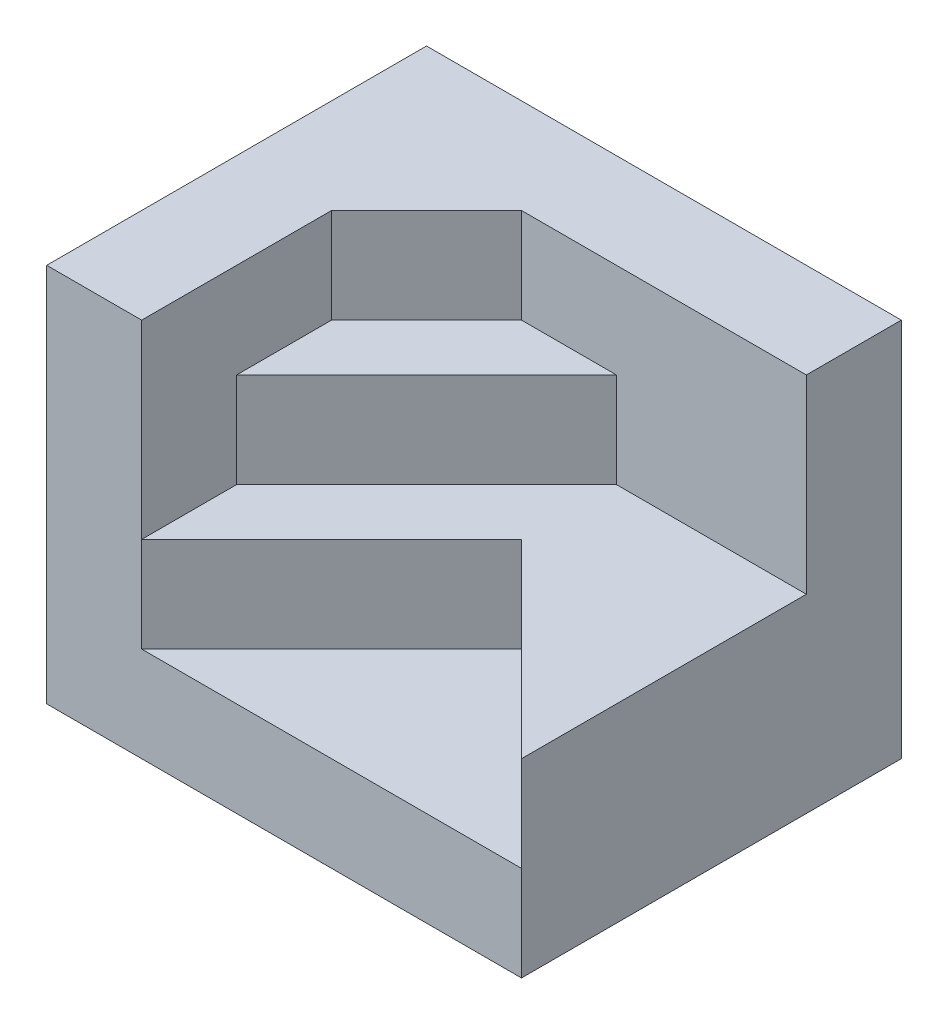
ISO-10303-21;
HEADER;
FILE_DESCRIPTION(('STEP AP214'),'2;1');
FILE_NAME('part.step','',(''),(''),'','','');
FILE_SCHEMA(('AUTOMOTIVE_DESIGN { 1 0 10303 214 1 1 1 1 }'));
ENDSEC;
DATA;
#1=APPLICATION_CONTEXT('core data for automotive mechanical design processes');
#2=APPLICATION_PROTOCOL_DEFINITION('international standard','automotive_design',2000,#1);
#3=PRODUCT_CONTEXT('',#1,'mechanical');
#4=PRODUCT('Part','Part','',(#3));
#5=PRODUCT_RELATED_PRODUCT_CATEGORY('part','',(#4));
#6=PRODUCT_DEFINITION_FORMATION('','',#4);
#7=PRODUCT_DEFINITION_CONTEXT('part definition',#1,'design');
#8=PRODUCT_DEFINITION('design','',#6,#7);
#9=PRODUCT_DEFINITION_SHAPE('','',#8);
#10=(LENGTH_UNIT() NAMED_UNIT(*) SI_UNIT(.MILLI.,.METRE.));
#11=(NAMED_UNIT(*) PLANE_ANGLE_UNIT() SI_UNIT($,.RADIAN.));
#12=(NAMED_UNIT(*) SI_UNIT($,.STERADIAN.) SOLID_ANGLE_UNIT());
#13=UNCERTAINTY_MEASURE_WITH_UNIT(LENGTH_MEASURE(1.E-05),#10,'distance_accuracy_value','');
#14=(GEOMETRIC_REPRESENTATION_CONTEXT(3) GLOBAL_UNCERTAINTY_ASSIGNED_CONTEXT((#13)) GLOBAL_UNIT_ASSIGNED_CONTEXT((#10,
#11,#12)) REPRESENTATION_CONTEXT('',''));
#15=CARTESIAN_POINT('',(0.,0.,0.));
#16=DIRECTION('',(0.,0.,1.));
#17=DIRECTION('',(1.,0.,0.));
#18=AXIS2_PLACEMENT_3D('',#15,#16,#17);
#19=CARTESIAN_POINT('',(-1.49999999999999,4.,0.));
#20=DIRECTION('',(-1.,0.,0.));
#21=DIRECTION('',(0.,0.,1.));
#22=AXIS2_PLACEMENT_3D('',#19,#20,#21);
#23=PLANE('',#22);
#24=DIRECTION('',(0.,-1.,0.));
#25=VECTOR('',#24,1.);
#26=CARTESIAN_POINT('',(-1.49999999999999,4.,2.));
#27=LINE('',#26,#25);
#28=CARTESIAN_POINT('',(-1.49999999999999,4.,2.));
#29=VERTEX_POINT('',#28);
#30=CARTESIAN_POINT('',(-1.49999999999999,2.,2.));
#31=VERTEX_POINT('',#30);
#32=EDGE_CURVE('E205',#29,#31,#27,.T.);
#33=ORIENTED_EDGE('',*,*,#32,.T.);
#34=DIRECTION('',(0.,0.,-1.));
#35=VECTOR('',#34,1.);
#36=CARTESIAN_POINT('',(-1.49999999999999,2.,0.));
#37=LINE('',#36,#35);
#38=CARTESIAN_POINT('',(-1.49999999999999,2.,1.));
#39=VERTEX_POINT('',#38);
#40=EDGE_CURVE('E169',#31,#39,#37,.T.);
#41=ORIENTED_EDGE('',*,*,#40,.T.);
#42=DIRECTION('',(0.,-1.,0.));
#43=VECTOR('',#42,1.);
#44=CARTESIAN_POINT('',(-1.49999999999999,3.,1.));
#45=LINE('',#44,#43);
#46=CARTESIAN_POINT('',(-1.49999999999999,3.,1.));
#47=VERTEX_POINT('',#46);
#48=EDGE_CURVE('E185',#47,#39,#45,.T.);
#49=ORIENTED_EDGE('',*,*,#48,.F.);
#50=DIRECTION('',(0.,0.,-1.));
#51=VECTOR('',#50,1.);
#52=CARTESIAN_POINT('',(-1.49999999999999,3.,0.));
#53=LINE('',#52,#51);
#54=CARTESIAN_POINT('',(-1.49999999999999,3.,0.));
#55=VERTEX_POINT('',#54);
#56=EDGE_CURVE('E183',#47,#55,#53,.T.);
#57=ORIENTED_EDGE('',*,*,#56,.T.);
#58=DIRECTION('',(0.,-1.,0.));
#59=VECTOR('',#58,1.);
#60=CARTESIAN_POINT('',(-1.49999999999999,4.,0.));
#61=LINE('',#60,#59);
#62=CARTESIAN_POINT('',(-1.49999999999999,4.,0.));
#63=VERTEX_POINT('',#62);
#64=EDGE_CURVE('E11',#63,#55,#61,.T.);
#65=ORIENTED_EDGE('',*,*,#64,.F.);
#66=DIRECTION('',(0.,0.,-1.));
#67=VECTOR('',#66,1.);
#68=CARTESIAN_POINT('',(-1.49999999999999,4.,0.));
#69=LINE('',#68,#67);
#70=EDGE_CURVE('E133',#29,#63,#69,.T.);
#71=ORIENTED_EDGE('',*,*,#70,.F.);
#72=EDGE_LOOP('',(#33,#41,#49,#57,#65,#71));
#73=FACE_BOUND('',#72,.T.);
#74=ADVANCED_FACE('F35',(#73),#23,.F.);
#75=CARTESIAN_POINT('',(-0.749999999999997,4.,-0.749999999999998));
#76=DIRECTION('',(-0.707106781186547,0.,-0.707106781186548));
#77=DIRECTION('',(-0.707106781186548,0.,0.707106781186547));
#78=AXIS2_PLACEMENT_3D('',#75,#76,#77);
#79=PLANE('',#78);
#80=ORIENTED_EDGE('',*,*,#64,.T.);
#81=DIRECTION('',(0.707106781186548,0.,-0.707106781186547));
#82=VECTOR('',#81,1.);
#83=CARTESIAN_POINT('',(-0.749999999999997,3.,-0.749999999999998));
#84=LINE('',#83,#82);
#85=CARTESIAN_POINT('',(-0.499999999999997,3.,-0.999999999999998));
#86=VERTEX_POINT('',#85);
#87=EDGE_CURVE('E181',#55,#86,#84,.T.);
#88=ORIENTED_EDGE('',*,*,#87,.T.);
#89=DIRECTION('',(0.,-1.,0.));
#90=VECTOR('',#89,1.);
#91=CARTESIAN_POINT('',(-0.499999999999997,4.,-0.999999999999998));
#92=LINE('',#91,#90);
#93=CARTESIAN_POINT('',(-0.499999999999997,4.,-0.999999999999998));
#94=VERTEX_POINT('',#93);
#95=EDGE_CURVE('E42',#94,#86,#92,.T.);
#96=ORIENTED_EDGE('',*,*,#95,.F.);
#97=DIRECTION('',(0.707106781186548,0.,-0.707106781186547));
#98=VECTOR('',#97,1.);
#99=CARTESIAN_POINT('',(-0.749999999999997,4.,-0.749999999999998));
#100=LINE('',#99,#98);
#101=EDGE_CURVE('E192',#63,#94,#100,.T.);
#102=ORIENTED_EDGE('',*,*,#101,.F.);
#103=EDGE_LOOP('',(#80,#88,#96,#102));
#104=FACE_BOUND('',#103,.T.);
#105=ADVANCED_FACE('F243',(#104),#79,.F.);
#106=CARTESIAN_POINT('',(0.,4.,-0.999999999999998));
#107=DIRECTION('',(0.,0.,-1.));
#108=DIRECTION('',(-1.,0.,0.));
#109=AXIS2_PLACEMENT_3D('',#106,#107,#108);
#110=PLANE('',#109);
#111=DIRECTION('',(0.,-1.,0.));
#112=VECTOR('',#111,1.);
#113=CARTESIAN_POINT('',(0.500000000000006,3.,-0.999999999999998));
#114=LINE('',#113,#112);
#115=CARTESIAN_POINT('',(0.500000000000006,3.,-0.999999999999998));
#116=VERTEX_POINT('',#115);
#117=CARTESIAN_POINT('',(0.500000000000006,2.,-0.999999999999998));
#118=VERTEX_POINT('',#117);
#119=EDGE_CURVE('E144',#116,#118,#114,.T.);
#120=ORIENTED_EDGE('',*,*,#119,.T.);
#121=DIRECTION('',(1.,0.,0.));
#122=VECTOR('',#121,1.);
#123=CARTESIAN_POINT('',(0.,2.,-0.999999999999998));
#124=LINE('',#123,#122);
#125=CARTESIAN_POINT('',(2.5,2.,-0.999999999999998));
#126=VERTEX_POINT('',#125);
#127=EDGE_CURVE('E164',#118,#126,#124,.T.);
#128=ORIENTED_EDGE('',*,*,#127,.T.);
#129=DIRECTION('',(0.,-1.,0.));
#130=VECTOR('',#129,1.);
#131=CARTESIAN_POINT('',(2.5,4.,-0.999999999999998));
#132=LINE('',#131,#130);
#133=CARTESIAN_POINT('',(2.5,4.,-0.999999999999998));
#134=VERTEX_POINT('',#133);
#135=EDGE_CURVE('E216',#134,#126,#132,.T.);
#136=ORIENTED_EDGE('',*,*,#135,.F.);
#137=DIRECTION('',(1.,0.,0.));
#138=VECTOR('',#137,1.);
#139=CARTESIAN_POINT('',(0.,4.,-0.999999999999998));
#140=LINE('',#139,#138);
#141=EDGE_CURVE('E194',#94,#134,#140,.T.);
#142=ORIENTED_EDGE('',*,*,#141,.F.);
#143=ORIENTED_EDGE('',*,*,#95,.T.);
#144=DIRECTION('',(1.,0.,0.));
#145=VECTOR('',#144,1.);
#146=CARTESIAN_POINT('',(0.,3.,-0.999999999999998));
#147=LINE('',#146,#145);
#148=EDGE_CURVE('E179',#86,#116,#147,.T.);
#149=ORIENTED_EDGE('',*,*,#148,.T.);
#150=EDGE_LOOP('',(#120,#128,#136,#142,#143,#149));
#151=FACE_BOUND('',#150,.T.);
#152=ADVANCED_FACE('F223',(#151),#110,.F.);
#153=CARTESIAN_POINT('',(2.5,4.,0.));
#154=DIRECTION('',(-1.,0.,0.));
#155=DIRECTION('',(0.,0.,1.));
#156=AXIS2_PLACEMENT_3D('',#153,#154,#155);
#157=PLANE('',#156);
#158=DIRECTION('',(0.,0.,-1.));
#159=VECTOR('',#158,1.);
#160=CARTESIAN_POINT('',(2.5,0.,0.));
#161=LINE('',#160,#159);
#162=CARTESIAN_POINT('',(2.5,0.,2.));
#163=VERTEX_POINT('',#162);
#164=CARTESIAN_POINT('',(2.5,0.,-2.));
#165=VERTEX_POINT('',#164);
#166=EDGE_CURVE('E138',#163,#165,#161,.T.);
#167=ORIENTED_EDGE('',*,*,#166,.T.);
#168=DIRECTION('',(0.,-1.,0.));
#169=VECTOR('',#168,1.);
#170=CARTESIAN_POINT('',(2.5,4.,-2.));
#171=LINE('',#170,#169);
#172=CARTESIAN_POINT('',(2.5,4.,-2.));
#173=VERTEX_POINT('',#172);
#174=EDGE_CURVE('E214',#173,#165,#171,.T.);
#175=ORIENTED_EDGE('',*,*,#174,.F.);
#176=DIRECTION('',(0.,0.,-1.));
#177=VECTOR('',#176,1.);
#178=CARTESIAN_POINT('',(2.5,4.,0.));
#179=LINE('',#178,#177);
#180=EDGE_CURVE('E196',#134,#173,#179,.T.);
#181=ORIENTED_EDGE('',*,*,#180,.F.);
#182=ORIENTED_EDGE('',*,*,#135,.T.);
#183=DIRECTION('',(0.,0.,-1.));
#184=VECTOR('',#183,1.);
#185=CARTESIAN_POINT('',(2.5,2.,0.));
#186=LINE('',#185,#184);
#187=CARTESIAN_POINT('',(2.5,2.,2.));
#188=VERTEX_POINT('',#187);
#189=EDGE_CURVE('E162',#188,#126,#186,.T.);
#190=ORIENTED_EDGE('',*,*,#189,.F.);
#191=DIRECTION('',(0.,-1.,0.));
#192=VECTOR('',#191,1.);
#193=CARTESIAN_POINT('',(2.5,2.,2.));
#194=LINE('',#193,#192);
#195=CARTESIAN_POINT('',(2.5,1.,2.));
#196=VERTEX_POINT('',#195);
#197=EDGE_CURVE('E150',#188,#196,#194,.T.);
#198=ORIENTED_EDGE('',*,*,#197,.T.);
#199=DIRECTION('',(0.,-1.,0.));
#200=VECTOR('',#199,1.);
#201=CARTESIAN_POINT('',(2.5,1.,2.));
#202=LINE('',#201,#200);
#203=EDGE_CURVE('E127',#196,#163,#202,.T.);
#204=ORIENTED_EDGE('',*,*,#203,.T.);
#205=EDGE_LOOP('',(#167,#175,#181,#182,#190,#198,#204));
#206=FACE_BOUND('',#205,.T.);
#207=ADVANCED_FACE('F147',(#206),#157,.F.);
#208=CARTESIAN_POINT('',(0.,4.,-2.));
#209=DIRECTION('',(0.,0.,-1.));
#210=DIRECTION('',(-1.,0.,0.));
#211=AXIS2_PLACEMENT_3D('',#208,#209,#210);
#212=PLANE('',#211);
#213=DIRECTION('',(1.,0.,0.));
#214=VECTOR('',#213,1.);
#215=CARTESIAN_POINT('',(0.,0.,-2.));
#216=LINE('',#215,#214);
#217=CARTESIAN_POINT('',(-2.5,0.,-2.));
#218=VERTEX_POINT('',#217);
#219=EDGE_CURVE('E141',#218,#165,#216,.T.);
#220=ORIENTED_EDGE('',*,*,#219,.F.);
#221=DIRECTION('',(0.,-1.,0.));
#222=VECTOR('',#221,1.);
#223=CARTESIAN_POINT('',(-2.5,4.,-2.));
#224=LINE('',#223,#222);
#225=CARTESIAN_POINT('',(-2.5,4.,-2.));
#226=VERTEX_POINT('',#225);
#227=EDGE_CURVE('E212',#226,#218,#224,.T.);
#228=ORIENTED_EDGE('',*,*,#227,.F.);
#229=DIRECTION('',(1.,0.,0.));
#230=VECTOR('',#229,1.);
#231=CARTESIAN_POINT('',(0.,4.,-2.));
#232=LINE('',#231,#230);
#233=EDGE_CURVE('E198',#226,#173,#232,.T.);
#234=ORIENTED_EDGE('',*,*,#233,.T.);
#235=ORIENTED_EDGE('',*,*,#174,.T.);
#236=EDGE_LOOP('',(#220,#228,#234,#235));
#237=FACE_BOUND('',#236,.T.);
#238=ADVANCED_FACE('F275',(#237),#212,.T.);
#239=CARTESIAN_POINT('',(-2.5,4.,0.));
#240=DIRECTION('',(-1.,0.,0.));
#241=DIRECTION('',(0.,0.,1.));
#242=AXIS2_PLACEMENT_3D('',#239,#240,#241);
#243=PLANE('',#242);
#244=DIRECTION('',(0.,0.,-1.));
#245=VECTOR('',#244,1.);
#246=CARTESIAN_POINT('',(-2.5,0.,0.));
#247=LINE('',#246,#245);
#248=CARTESIAN_POINT('',(-2.5,0.,2.));
#249=VERTEX_POINT('',#248);
#250=EDGE_CURVE('E134',#249,#218,#247,.T.);
#251=ORIENTED_EDGE('',*,*,#250,.F.);
#252=DIRECTION('',(0.,-1.,0.));
#253=VECTOR('',#252,1.);
#254=CARTESIAN_POINT('',(-2.5,4.,2.));
#255=LINE('',#254,#253);
#256=CARTESIAN_POINT('',(-2.5,4.,2.));
#257=VERTEX_POINT('',#256);
#258=EDGE_CURVE('E129',#257,#249,#255,.T.);
#259=ORIENTED_EDGE('',*,*,#258,.F.);
#260=DIRECTION('',(0.,0.,-1.));
#261=VECTOR('',#260,1.);
#262=CARTESIAN_POINT('',(-2.5,4.,0.));
#263=LINE('',#262,#261);
#264=EDGE_CURVE('E201',#257,#226,#263,.T.);
#265=ORIENTED_EDGE('',*,*,#264,.T.);
#266=ORIENTED_EDGE('',*,*,#227,.T.);
#267=EDGE_LOOP('',(#251,#259,#265,#266));
#268=FACE_BOUND('',#267,.T.);
#269=ADVANCED_FACE('F278',(#268),#243,.T.);
#270=CARTESIAN_POINT('',(0.,4.,2.));
#271=DIRECTION('',(0.,0.,-1.));
#272=DIRECTION('',(-1.,0.,0.));
#273=AXIS2_PLACEMENT_3D('',#270,#271,#272);
#274=PLANE('',#273);
#275=DIRECTION('',(1.,0.,0.));
#276=VECTOR('',#275,1.);
#277=CARTESIAN_POINT('',(0.,0.,2.));
#278=LINE('',#277,#276);
#279=EDGE_CURVE('E123',#249,#163,#278,.T.);
#280=ORIENTED_EDGE('',*,*,#279,.T.);
#281=ORIENTED_EDGE('',*,*,#203,.F.);
#282=DIRECTION('',(1.,0.,0.));
#283=VECTOR('',#282,1.);
#284=CARTESIAN_POINT('',(0.,1.,2.));
#285=LINE('',#284,#283);
#286=CARTESIAN_POINT('',(-1.49999999999999,1.,2.));
#287=VERTEX_POINT('',#286);
#288=EDGE_CURVE('E153',#287,#196,#285,.T.);
#289=ORIENTED_EDGE('',*,*,#288,.F.);
#290=DIRECTION('',(0.,-1.,0.));
#291=VECTOR('',#290,1.);
#292=CARTESIAN_POINT('',(-1.49999999999999,2.,2.));
#293=LINE('',#292,#291);
#294=EDGE_CURVE('E49',#31,#287,#293,.T.);
#295=ORIENTED_EDGE('',*,*,#294,.F.);
#296=ORIENTED_EDGE('',*,*,#32,.F.);
#297=DIRECTION('',(1.,0.,0.));
#298=VECTOR('',#297,1.);
#299=CARTESIAN_POINT('',(0.,4.,2.));
#300=LINE('',#299,#298);
#301=EDGE_CURVE('E204',#257,#29,#300,.T.);
#302=ORIENTED_EDGE('',*,*,#301,.F.);
#303=ORIENTED_EDGE('',*,*,#258,.T.);
#304=EDGE_LOOP('',(#280,#281,#289,#295,#296,#302,#303));
#305=FACE_BOUND('',#304,.T.);
#306=ADVANCED_FACE('F125',(#305),#274,.F.);
#307=CARTESIAN_POINT('',(0.,4.,0.));
#308=DIRECTION('',(0.,1.,0.));
#309=DIRECTION('',(0.,0.,1.));
#310=AXIS2_PLACEMENT_3D('',#307,#308,#309);
#311=PLANE('',#310);
#312=ORIENTED_EDGE('',*,*,#70,.T.);
#313=ORIENTED_EDGE('',*,*,#101,.T.);
#314=ORIENTED_EDGE('',*,*,#141,.T.);
#315=ORIENTED_EDGE('',*,*,#180,.T.);
#316=ORIENTED_EDGE('',*,*,#233,.F.);
#317=ORIENTED_EDGE('',*,*,#264,.F.);
#318=ORIENTED_EDGE('',*,*,#301,.T.);
#319=EDGE_LOOP('',(#312,#313,#314,#315,#316,#317,#318));
#320=FACE_BOUND('',#319,.T.);
#321=ADVANCED_FACE('F239',(#320),#311,.T.);
#322=CARTESIAN_POINT('',(0.,0.,0.));
#323=DIRECTION('',(0.,1.,0.));
#324=DIRECTION('',(0.,0.,1.));
#325=AXIS2_PLACEMENT_3D('',#322,#323,#324);
#326=PLANE('',#325);
#327=ORIENTED_EDGE('',*,*,#166,.F.);
#328=ORIENTED_EDGE('',*,*,#279,.F.);
#329=ORIENTED_EDGE('',*,*,#250,.T.);
#330=ORIENTED_EDGE('',*,*,#219,.T.);
#331=EDGE_LOOP('',(#327,#328,#329,#330));
#332=FACE_BOUND('',#331,.T.);
#333=ADVANCED_FACE('F139',(#332),#326,.F.);
#334=CARTESIAN_POINT('',(-0.249999999999996,3.,-0.249999999999996));
#335=DIRECTION('',(0.707106781186547,0.,0.707106781186548));
#336=DIRECTION('',(0.707106781186548,0.,-0.707106781186547));
#337=AXIS2_PLACEMENT_3D('',#334,#335,#336);
#338=PLANE('',#337);
#339=DIRECTION('',(-0.707106781186548,0.,0.707106781186547));
#340=VECTOR('',#339,1.);
#341=CARTESIAN_POINT('',(-0.249999999999996,2.,-0.249999999999996));
#342=LINE('',#341,#340);
#343=EDGE_CURVE('E167',#118,#39,#342,.T.);
#344=ORIENTED_EDGE('',*,*,#343,.F.);
#345=ORIENTED_EDGE('',*,*,#119,.F.);
#346=DIRECTION('',(-0.707106781186548,0.,0.707106781186547));
#347=VECTOR('',#346,1.);
#348=CARTESIAN_POINT('',(-0.249999999999996,3.,-0.249999999999996));
#349=LINE('',#348,#347);
#350=EDGE_CURVE('E176',#116,#47,#349,.T.);
#351=ORIENTED_EDGE('',*,*,#350,.T.);
#352=ORIENTED_EDGE('',*,*,#48,.T.);
#353=EDGE_LOOP('',(#344,#345,#351,#352));
#354=FACE_BOUND('',#353,.T.);
#355=ADVANCED_FACE('F234',(#354),#338,.T.);
#356=CARTESIAN_POINT('',(0.,3.,0.));
#357=DIRECTION('',(0.,1.,0.));
#358=DIRECTION('',(0.,0.,1.));
#359=AXIS2_PLACEMENT_3D('',#356,#357,#358);
#360=PLANE('',#359);
#361=ORIENTED_EDGE('',*,*,#350,.F.);
#362=ORIENTED_EDGE('',*,*,#148,.F.);
#363=ORIENTED_EDGE('',*,*,#87,.F.);
#364=ORIENTED_EDGE('',*,*,#56,.F.);
#365=EDGE_LOOP('',(#361,#362,#363,#364));
#366=FACE_BOUND('',#365,.T.);
#367=ADVANCED_FACE('F230',(#366),#360,.T.);
#368=CARTESIAN_POINT('',(0.250000000000003,2.,0.250000000000003));
#369=DIRECTION('',(-0.707106781186548,0.,-0.707106781186547));
#370=DIRECTION('',(-0.707106781186547,0.,0.707106781186548));
#371=AXIS2_PLACEMENT_3D('',#368,#369,#370);
#372=PLANE('',#371);
#373=ORIENTED_EDGE('',*,*,#294,.T.);
#374=DIRECTION('',(0.707106781186547,0.,-0.707106781186548));
#375=VECTOR('',#374,1.);
#376=CARTESIAN_POINT('',(0.250000000000003,1.,0.250000000000003));
#377=LINE('',#376,#375);
#378=CARTESIAN_POINT('',(0.500000000000004,1.,0.));
#379=VERTEX_POINT('',#378);
#380=EDGE_CURVE('E54',#287,#379,#377,.T.);
#381=ORIENTED_EDGE('',*,*,#380,.T.);
#382=DIRECTION('',(0.,-1.,0.));
#383=VECTOR('',#382,1.);
#384=CARTESIAN_POINT('',(0.500000000000004,2.,0.));
#385=LINE('',#384,#383);
#386=CARTESIAN_POINT('',(0.500000000000004,2.,0.));
#387=VERTEX_POINT('',#386);
#388=EDGE_CURVE('E174',#387,#379,#385,.T.);
#389=ORIENTED_EDGE('',*,*,#388,.F.);
#390=DIRECTION('',(0.707106781186547,0.,-0.707106781186548));
#391=VECTOR('',#390,1.);
#392=CARTESIAN_POINT('',(0.250000000000003,2.,0.250000000000003));
#393=LINE('',#392,#391);
#394=EDGE_CURVE('E152',#31,#387,#393,.T.);
#395=ORIENTED_EDGE('',*,*,#394,.F.);
#396=EDGE_LOOP('',(#373,#381,#389,#395));
#397=FACE_BOUND('',#396,.T.);
#398=ADVANCED_FACE('F255',(#397),#372,.F.);
#399=CARTESIAN_POINT('',(0.250000000000001,2.,-0.250000000000001));
#400=DIRECTION('',(0.707106781186547,0.,-0.707106781186547));
#401=DIRECTION('',(-0.707106781186548,0.,-0.707106781186548));
#402=AXIS2_PLACEMENT_3D('',#399,#400,#401);
#403=PLANE('',#402);
#404=ORIENTED_EDGE('',*,*,#388,.T.);
#405=DIRECTION('',(0.707106781186548,0.,0.707106781186548));
#406=VECTOR('',#405,1.);
#407=CARTESIAN_POINT('',(0.250000000000001,1.,-0.250000000000001));
#408=LINE('',#407,#406);
#409=EDGE_CURVE('E251',#379,#196,#408,.T.);
#410=ORIENTED_EDGE('',*,*,#409,.T.);
#411=ORIENTED_EDGE('',*,*,#197,.F.);
#412=DIRECTION('',(0.707106781186548,0.,0.707106781186548));
#413=VECTOR('',#412,1.);
#414=CARTESIAN_POINT('',(0.250000000000001,2.,-0.250000000000001));
#415=LINE('',#414,#413);
#416=EDGE_CURVE('E156',#387,#188,#415,.T.);
#417=ORIENTED_EDGE('',*,*,#416,.F.);
#418=EDGE_LOOP('',(#404,#410,#411,#417));
#419=FACE_BOUND('',#418,.T.);
#420=ADVANCED_FACE('F254',(#419),#403,.F.);
#421=CARTESIAN_POINT('',(0.,2.,0.));
#422=DIRECTION('',(0.,1.,0.));
#423=DIRECTION('',(0.,0.,1.));
#424=AXIS2_PLACEMENT_3D('',#421,#422,#423);
#425=PLANE('',#424);
#426=ORIENTED_EDGE('',*,*,#394,.T.);
#427=ORIENTED_EDGE('',*,*,#416,.T.);
#428=ORIENTED_EDGE('',*,*,#189,.T.);
#429=ORIENTED_EDGE('',*,*,#127,.F.);
#430=ORIENTED_EDGE('',*,*,#343,.T.);
#431=ORIENTED_EDGE('',*,*,#40,.F.);
#432=EDGE_LOOP('',(#426,#427,#428,#429,#430,#431));
#433=FACE_BOUND('',#432,.T.);
#434=ADVANCED_FACE('F247',(#433),#425,.T.);
#435=CARTESIAN_POINT('',(0.,1.,0.));
#436=DIRECTION('',(0.,1.,0.));
#437=DIRECTION('',(0.,0.,1.));
#438=AXIS2_PLACEMENT_3D('',#435,#436,#437);
#439=PLANE('',#438);
#440=ORIENTED_EDGE('',*,*,#409,.F.);
#441=ORIENTED_EDGE('',*,*,#380,.F.);
#442=ORIENTED_EDGE('',*,*,#288,.T.);
#443=EDGE_LOOP('',(#440,#441,#442));
#444=FACE_BOUND('',#443,.T.);
#445=ADVANCED_FACE('F250',(#444),#439,.T.);
#446=CLOSED_SHELL('',(#74,#105,#152,#207,#238,#269,#306,#321,#333,#355,#367,#398,#420,#434,#445));
#447=MANIFOLD_SOLID_BREP('B2',#446);
#448=ADVANCED_BREP_SHAPE_REPRESENTATION('',(#18,#447),#14);
#449=SHAPE_DEFINITION_REPRESENTATION(#9,#448);
ENDSEC;
END-ISO-10303-21;
